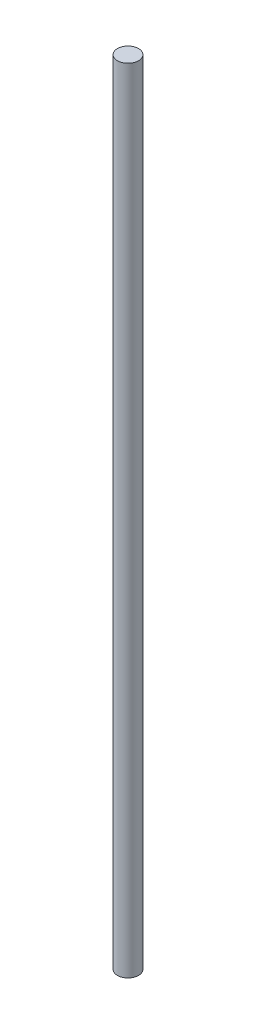
ISO-10303-21;
HEADER;
FILE_DESCRIPTION(('STEP AP214'),'2;1');
FILE_NAME('part.step','',(''),(''),'','','');
FILE_SCHEMA(('AUTOMOTIVE_DESIGN { 1 0 10303 214 1 1 1 1 }'));
ENDSEC;
DATA;
#1=APPLICATION_CONTEXT('core data for automotive mechanical design processes');
#2=APPLICATION_PROTOCOL_DEFINITION('international standard','automotive_design',2000,#1);
#3=PRODUCT_CONTEXT('',#1,'mechanical');
#4=PRODUCT('Part','Part','',(#3));
#5=PRODUCT_RELATED_PRODUCT_CATEGORY('part','',(#4));
#6=PRODUCT_DEFINITION_FORMATION('','',#4);
#7=PRODUCT_DEFINITION_CONTEXT('part definition',#1,'design');
#8=PRODUCT_DEFINITION('design','',#6,#7);
#9=PRODUCT_DEFINITION_SHAPE('','',#8);
#10=(LENGTH_UNIT() NAMED_UNIT(*) SI_UNIT(.MILLI.,.METRE.));
#11=(NAMED_UNIT(*) PLANE_ANGLE_UNIT() SI_UNIT($,.RADIAN.));
#12=(NAMED_UNIT(*) SI_UNIT($,.STERADIAN.) SOLID_ANGLE_UNIT());
#13=UNCERTAINTY_MEASURE_WITH_UNIT(LENGTH_MEASURE(1.E-05),#10,'distance_accuracy_value','');
#14=(GEOMETRIC_REPRESENTATION_CONTEXT(3) GLOBAL_UNCERTAINTY_ASSIGNED_CONTEXT((#13)) GLOBAL_UNIT_ASSIGNED_CONTEXT((#10,
#11,#12)) REPRESENTATION_CONTEXT('',''));
#15=CARTESIAN_POINT('',(0.,0.,0.));
#16=DIRECTION('',(0.,0.,1.));
#17=DIRECTION('',(1.,0.,0.));
#18=AXIS2_PLACEMENT_3D('',#15,#16,#17);
#19=CARTESIAN_POINT('',(0.,300.,0.));
#20=DIRECTION('',(0.,-1.,0.));
#21=DIRECTION('',(0.,0.,-1.));
#22=AXIS2_PLACEMENT_3D('',#19,#20,#21);
#23=CYLINDRICAL_SURFACE('',#22,4.);
#24=CARTESIAN_POINT('',(0.,300.,0.));
#25=DIRECTION('',(0.,1.,0.));
#26=DIRECTION('',(0.,0.,1.));
#27=AXIS2_PLACEMENT_3D('',#24,#25,#26);
#28=CIRCLE('',#27,4.);
#29=CARTESIAN_POINT('',(0.,300.,4.));
#30=VERTEX_POINT('',#29);
#31=EDGE_CURVE('E10',#30,#30,#28,.T.);
#32=ORIENTED_EDGE('',*,*,#31,.F.);
#33=EDGE_LOOP('',(#32));
#34=FACE_BOUND('',#33,.T.);
#35=CARTESIAN_POINT('',(0.,0.,0.));
#36=DIRECTION('',(0.,1.,0.));
#37=DIRECTION('',(0.,0.,1.));
#38=AXIS2_PLACEMENT_3D('',#35,#36,#37);
#39=CIRCLE('',#38,4.);
#40=CARTESIAN_POINT('',(0.,0.,4.));
#41=VERTEX_POINT('',#40);
#42=EDGE_CURVE('E38',#41,#41,#39,.T.);
#43=ORIENTED_EDGE('',*,*,#42,.T.);
#44=EDGE_LOOP('',(#43));
#45=FACE_BOUND('',#44,.T.);
#46=ADVANCED_FACE('F35',(#34,#45),#23,.T.);
#47=CARTESIAN_POINT('',(0.,300.,0.));
#48=DIRECTION('',(0.,1.,0.));
#49=DIRECTION('',(0.,0.,1.));
#50=AXIS2_PLACEMENT_3D('',#47,#48,#49);
#51=PLANE('',#50);
#52=ORIENTED_EDGE('',*,*,#31,.T.);
#53=EDGE_LOOP('',(#52));
#54=FACE_BOUND('',#53,.T.);
#55=ADVANCED_FACE('F50',(#54),#51,.T.);
#56=CARTESIAN_POINT('',(0.,0.,0.));
#57=DIRECTION('',(0.,1.,0.));
#58=DIRECTION('',(0.,0.,1.));
#59=AXIS2_PLACEMENT_3D('',#56,#57,#58);
#60=PLANE('',#59);
#61=ORIENTED_EDGE('',*,*,#42,.F.);
#62=EDGE_LOOP('',(#61));
#63=FACE_BOUND('',#62,.T.);
#64=ADVANCED_FACE('F48',(#63),#60,.F.);
#65=CLOSED_SHELL('',(#46,#55,#64));
#66=MANIFOLD_SOLID_BREP('B2',#65);
#67=ADVANCED_BREP_SHAPE_REPRESENTATION('',(#18,#66),#14);
#68=SHAPE_DEFINITION_REPRESENTATION(#9,#67);
ENDSEC;
END-ISO-10303-21;
